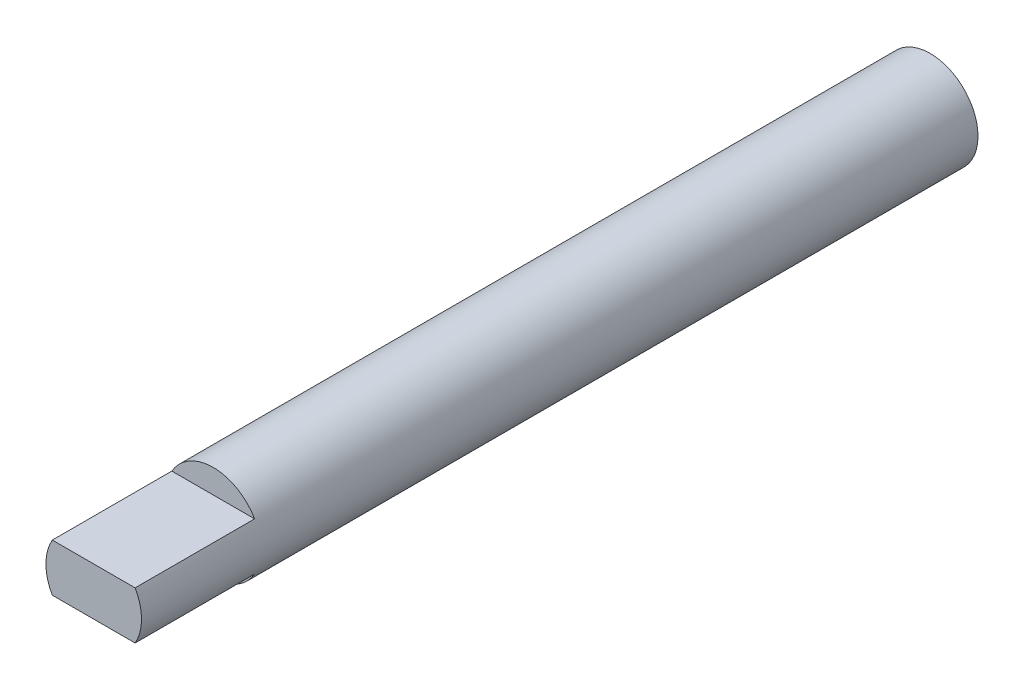
ISO-10303-21;
HEADER;
FILE_DESCRIPTION(('STEP AP214'),'2;1');
FILE_NAME('part.step','',(''),(''),'','','');
FILE_SCHEMA(('AUTOMOTIVE_DESIGN { 1 0 10303 214 1 1 1 1 }'));
ENDSEC;
DATA;
#1=APPLICATION_CONTEXT('core data for automotive mechanical design processes');
#2=APPLICATION_PROTOCOL_DEFINITION('international standard','automotive_design',2000,#1);
#3=PRODUCT_CONTEXT('',#1,'mechanical');
#4=PRODUCT('Part','Part','',(#3));
#5=PRODUCT_RELATED_PRODUCT_CATEGORY('part','',(#4));
#6=PRODUCT_DEFINITION_FORMATION('','',#4);
#7=PRODUCT_DEFINITION_CONTEXT('part definition',#1,'design');
#8=PRODUCT_DEFINITION('design','',#6,#7);
#9=PRODUCT_DEFINITION_SHAPE('','',#8);
#10=(LENGTH_UNIT() NAMED_UNIT(*) SI_UNIT(.MILLI.,.METRE.));
#11=(NAMED_UNIT(*) PLANE_ANGLE_UNIT() SI_UNIT($,.RADIAN.));
#12=(NAMED_UNIT(*) SI_UNIT($,.STERADIAN.) SOLID_ANGLE_UNIT());
#13=UNCERTAINTY_MEASURE_WITH_UNIT(LENGTH_MEASURE(1.E-05),#10,'distance_accuracy_value','');
#14=(GEOMETRIC_REPRESENTATION_CONTEXT(3) GLOBAL_UNCERTAINTY_ASSIGNED_CONTEXT((#13)) GLOBAL_UNIT_ASSIGNED_CONTEXT((#10,
#11,#12)) REPRESENTATION_CONTEXT('',''));
#15=CARTESIAN_POINT('',(0.,0.,0.));
#16=DIRECTION('',(0.,0.,1.));
#17=DIRECTION('',(1.,0.,0.));
#18=AXIS2_PLACEMENT_3D('',#15,#16,#17);
#19=CARTESIAN_POINT('',(0.,0.,35.));
#20=DIRECTION('',(0.,0.,-1.));
#21=DIRECTION('',(-1.,0.,0.));
#22=AXIS2_PLACEMENT_3D('',#19,#20,#21);
#23=CYLINDRICAL_SURFACE('',#22,4.);
#24=CARTESIAN_POINT('',(0.,0.,35.));
#25=DIRECTION('',(0.,0.,1.));
#26=DIRECTION('',(1.,0.,0.));
#27=AXIS2_PLACEMENT_3D('',#24,#25,#26);
#28=CIRCLE('',#27,4.);
#29=CARTESIAN_POINT('',(-3.46410161513775,2.,35.));
#30=VERTEX_POINT('',#29);
#31=CARTESIAN_POINT('',(-3.46410161513775,-2.,35.));
#32=VERTEX_POINT('',#31);
#33=EDGE_CURVE('E89',#30,#32,#28,.T.);
#34=ORIENTED_EDGE('',*,*,#33,.F.);
#35=DIRECTION('',(0.,0.,-1.));
#36=VECTOR('',#35,1.);
#37=CARTESIAN_POINT('',(-3.46410161513775,2.,35.));
#38=LINE('',#37,#36);
#39=CARTESIAN_POINT('',(-3.46410161513775,2.,25.));
#40=VERTEX_POINT('',#39);
#41=EDGE_CURVE('E47',#30,#40,#38,.T.);
#42=ORIENTED_EDGE('',*,*,#41,.T.);
#43=CARTESIAN_POINT('',(0.,0.,25.));
#44=DIRECTION('',(0.,0.,-1.));
#45=DIRECTION('',(-1.,0.,0.));
#46=AXIS2_PLACEMENT_3D('',#43,#44,#45);
#47=CIRCLE('',#46,4.);
#48=CARTESIAN_POINT('',(3.46410161513775,2.,25.));
#49=VERTEX_POINT('',#48);
#50=EDGE_CURVE('E11',#40,#49,#47,.T.);
#51=ORIENTED_EDGE('',*,*,#50,.T.);
#52=DIRECTION('',(0.,0.,-1.));
#53=VECTOR('',#52,1.);
#54=CARTESIAN_POINT('',(3.46410161513775,2.,35.));
#55=LINE('',#54,#53);
#56=CARTESIAN_POINT('',(3.46410161513775,2.,35.));
#57=VERTEX_POINT('',#56);
#58=EDGE_CURVE('E75',#49,#57,#55,.F.);
#59=ORIENTED_EDGE('',*,*,#58,.T.);
#60=CARTESIAN_POINT('',(3.46410161513775,-2.,35.));
#61=VERTEX_POINT('',#60);
#62=EDGE_CURVE('E84',#61,#57,#28,.T.);
#63=ORIENTED_EDGE('',*,*,#62,.F.);
#64=DIRECTION('',(0.,0.,-1.));
#65=VECTOR('',#64,1.);
#66=CARTESIAN_POINT('',(3.46410161513775,-2.,35.));
#67=LINE('',#66,#65);
#68=CARTESIAN_POINT('',(3.46410161513775,-2.,25.));
#69=VERTEX_POINT('',#68);
#70=EDGE_CURVE('E55',#61,#69,#67,.T.);
#71=ORIENTED_EDGE('',*,*,#70,.T.);
#72=CARTESIAN_POINT('',(0.,0.,25.));
#73=DIRECTION('',(0.,0.,-1.));
#74=DIRECTION('',(-1.,0.,0.));
#75=AXIS2_PLACEMENT_3D('',#72,#73,#74);
#76=CIRCLE('',#75,4.);
#77=CARTESIAN_POINT('',(-3.46410161513775,-2.,25.));
#78=VERTEX_POINT('',#77);
#79=EDGE_CURVE('E80',#69,#78,#76,.T.);
#80=ORIENTED_EDGE('',*,*,#79,.T.);
#81=DIRECTION('',(0.,0.,-1.));
#82=VECTOR('',#81,1.);
#83=CARTESIAN_POINT('',(-3.46410161513775,-2.,35.));
#84=LINE('',#83,#82);
#85=EDGE_CURVE('E100',#78,#32,#84,.F.);
#86=ORIENTED_EDGE('',*,*,#85,.T.);
#87=EDGE_LOOP('',(#34,#42,#51,#59,#63,#71,#80,#86));
#88=FACE_BOUND('',#87,.T.);
#89=CARTESIAN_POINT('',(0.,0.,-35.));
#90=DIRECTION('',(0.,0.,1.));
#91=DIRECTION('',(1.,0.,0.));
#92=AXIS2_PLACEMENT_3D('',#89,#90,#91);
#93=CIRCLE('',#92,4.);
#94=CARTESIAN_POINT('',(4.,0.,-35.));
#95=VERTEX_POINT('',#94);
#96=EDGE_CURVE('E92',#95,#95,#93,.T.);
#97=ORIENTED_EDGE('',*,*,#96,.T.);
#98=EDGE_LOOP('',(#97));
#99=FACE_BOUND('',#98,.T.);
#100=ADVANCED_FACE('F33',(#88,#99),#23,.T.);
#101=CARTESIAN_POINT('',(0.,0.,35.));
#102=DIRECTION('',(0.,0.,1.));
#103=DIRECTION('',(1.,0.,0.));
#104=AXIS2_PLACEMENT_3D('',#101,#102,#103);
#105=PLANE('',#104);
#106=DIRECTION('',(1.,0.,0.));
#107=VECTOR('',#106,1.);
#108=CARTESIAN_POINT('',(0.,2.,35.));
#109=LINE('',#108,#107);
#110=EDGE_CURVE('E40',#30,#57,#109,.T.);
#111=ORIENTED_EDGE('',*,*,#110,.F.);
#112=ORIENTED_EDGE('',*,*,#33,.T.);
#113=DIRECTION('',(-1.,0.,0.));
#114=VECTOR('',#113,1.);
#115=CARTESIAN_POINT('',(0.,-2.,35.));
#116=LINE('',#115,#114);
#117=EDGE_CURVE('E88',#61,#32,#116,.T.);
#118=ORIENTED_EDGE('',*,*,#117,.F.);
#119=ORIENTED_EDGE('',*,*,#62,.T.);
#120=EDGE_LOOP('',(#111,#112,#118,#119));
#121=FACE_BOUND('',#120,.T.);
#122=ADVANCED_FACE('F87',(#121),#105,.T.);
#123=CARTESIAN_POINT('',(0.,0.,-35.));
#124=DIRECTION('',(0.,0.,1.));
#125=DIRECTION('',(1.,0.,0.));
#126=AXIS2_PLACEMENT_3D('',#123,#124,#125);
#127=PLANE('',#126);
#128=ORIENTED_EDGE('',*,*,#96,.F.);
#129=EDGE_LOOP('',(#128));
#130=FACE_BOUND('',#129,.T.);
#131=ADVANCED_FACE('F123',(#130),#127,.F.);
#132=CARTESIAN_POINT('',(0.,0.,25.));
#133=DIRECTION('',(0.,0.,-1.));
#134=DIRECTION('',(-1.,0.,0.));
#135=AXIS2_PLACEMENT_3D('',#132,#133,#134);
#136=PLANE('',#135);
#137=DIRECTION('',(-1.,0.,0.));
#138=VECTOR('',#137,1.);
#139=CARTESIAN_POINT('',(-4.,-2.,25.));
#140=LINE('',#139,#138);
#141=EDGE_CURVE('E104',#69,#78,#140,.T.);
#142=ORIENTED_EDGE('',*,*,#141,.T.);
#143=ORIENTED_EDGE('',*,*,#79,.F.);
#144=EDGE_LOOP('',(#142,#143));
#145=FACE_BOUND('',#144,.T.);
#146=ADVANCED_FACE('F103',(#145),#136,.F.);
#147=CARTESIAN_POINT('',(-4.,-2.,25.));
#148=DIRECTION('',(0.,1.,0.));
#149=DIRECTION('',(0.,0.,1.));
#150=AXIS2_PLACEMENT_3D('',#147,#148,#149);
#151=PLANE('',#150);
#152=ORIENTED_EDGE('',*,*,#117,.T.);
#153=ORIENTED_EDGE('',*,*,#85,.F.);
#154=ORIENTED_EDGE('',*,*,#141,.F.);
#155=ORIENTED_EDGE('',*,*,#70,.F.);
#156=EDGE_LOOP('',(#152,#153,#154,#155));
#157=FACE_BOUND('',#156,.T.);
#158=ADVANCED_FACE('F105',(#157),#151,.F.);
#159=CARTESIAN_POINT('',(0.,0.,25.));
#160=DIRECTION('',(0.,0.,-1.));
#161=DIRECTION('',(-1.,0.,0.));
#162=AXIS2_PLACEMENT_3D('',#159,#160,#161);
#163=PLANE('',#162);
#164=DIRECTION('',(1.,0.,0.));
#165=VECTOR('',#164,1.);
#166=CARTESIAN_POINT('',(-4.,2.,25.));
#167=LINE('',#166,#165);
#168=EDGE_CURVE('E85',#40,#49,#167,.T.);
#169=ORIENTED_EDGE('',*,*,#168,.T.);
#170=ORIENTED_EDGE('',*,*,#50,.F.);
#171=EDGE_LOOP('',(#169,#170));
#172=FACE_BOUND('',#171,.T.);
#173=ADVANCED_FACE('F110',(#172),#163,.F.);
#174=CARTESIAN_POINT('',(-4.,2.,25.));
#175=DIRECTION('',(0.,-1.,0.));
#176=DIRECTION('',(0.,0.,-1.));
#177=AXIS2_PLACEMENT_3D('',#174,#175,#176);
#178=PLANE('',#177);
#179=ORIENTED_EDGE('',*,*,#110,.T.);
#180=ORIENTED_EDGE('',*,*,#58,.F.);
#181=ORIENTED_EDGE('',*,*,#168,.F.);
#182=ORIENTED_EDGE('',*,*,#41,.F.);
#183=EDGE_LOOP('',(#179,#180,#181,#182));
#184=FACE_BOUND('',#183,.T.);
#185=ADVANCED_FACE('F74',(#184),#178,.F.);
#186=CLOSED_SHELL('',(#100,#122,#131,#146,#158,#173,#185));
#187=MANIFOLD_SOLID_BREP('B2',#186);
#188=ADVANCED_BREP_SHAPE_REPRESENTATION('',(#18,#187),#14);
#189=SHAPE_DEFINITION_REPRESENTATION(#9,#188);
ENDSEC;
END-ISO-10303-21;
